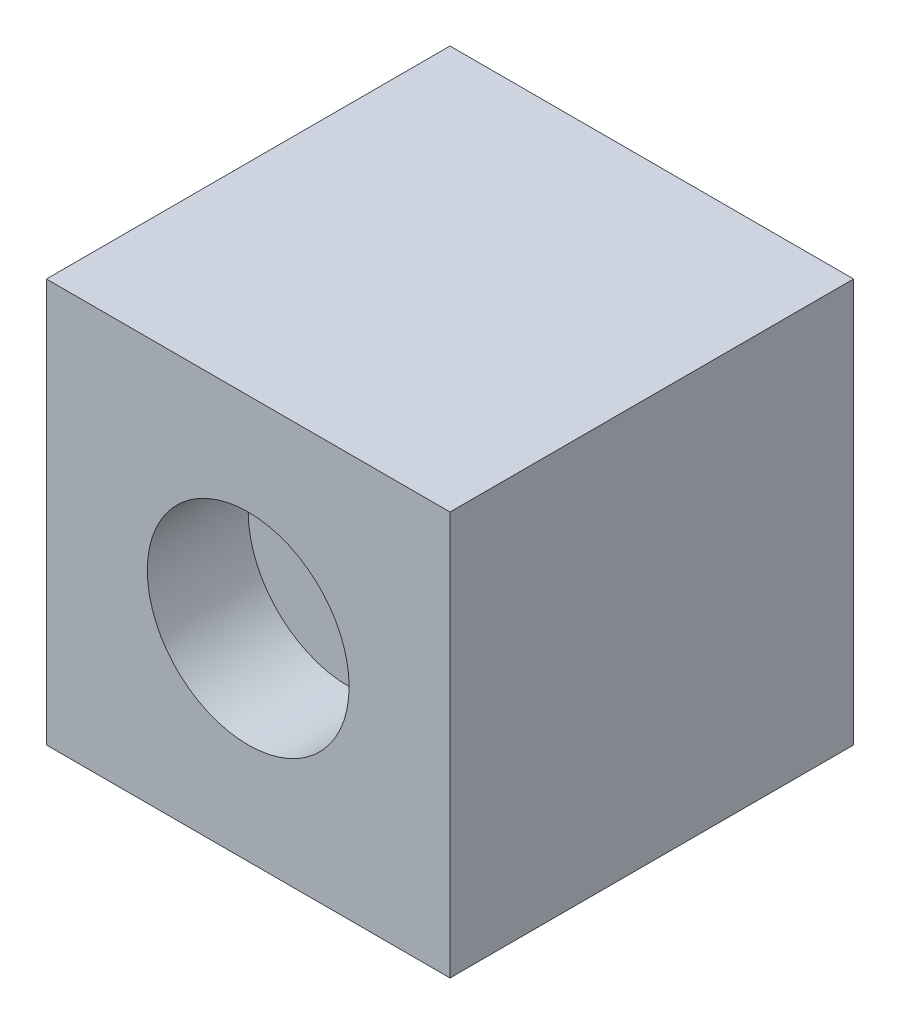
ISO-10303-21;
HEADER;
FILE_DESCRIPTION(('STEP AP214'),'2;1');
FILE_NAME('part.step','',(''),(''),'','','');
FILE_SCHEMA(('AUTOMOTIVE_DESIGN { 1 0 10303 214 1 1 1 1 }'));
ENDSEC;
DATA;
#1=APPLICATION_CONTEXT('core data for automotive mechanical design processes');
#2=APPLICATION_PROTOCOL_DEFINITION('international standard','automotive_design',2000,#1);
#3=PRODUCT_CONTEXT('',#1,'mechanical');
#4=PRODUCT('Part','Part','',(#3));
#5=PRODUCT_RELATED_PRODUCT_CATEGORY('part','',(#4));
#6=PRODUCT_DEFINITION_FORMATION('','',#4);
#7=PRODUCT_DEFINITION_CONTEXT('part definition',#1,'design');
#8=PRODUCT_DEFINITION('design','',#6,#7);
#9=PRODUCT_DEFINITION_SHAPE('','',#8);
#10=(LENGTH_UNIT() NAMED_UNIT(*) SI_UNIT(.MILLI.,.METRE.));
#11=(NAMED_UNIT(*) PLANE_ANGLE_UNIT() SI_UNIT($,.RADIAN.));
#12=(NAMED_UNIT(*) SI_UNIT($,.STERADIAN.) SOLID_ANGLE_UNIT());
#13=UNCERTAINTY_MEASURE_WITH_UNIT(LENGTH_MEASURE(1.E-05),#10,'distance_accuracy_value','');
#14=(GEOMETRIC_REPRESENTATION_CONTEXT(3) GLOBAL_UNCERTAINTY_ASSIGNED_CONTEXT((#13)) GLOBAL_UNIT_ASSIGNED_CONTEXT((#10,
#11,#12)) REPRESENTATION_CONTEXT('',''));
#15=CARTESIAN_POINT('',(0.,0.,0.));
#16=DIRECTION('',(0.,0.,1.));
#17=DIRECTION('',(1.,0.,0.));
#18=AXIS2_PLACEMENT_3D('',#15,#16,#17);
#19=CARTESIAN_POINT('',(-25.4,25.4,50.8));
#20=DIRECTION('',(1.,0.,0.));
#21=DIRECTION('',(0.,1.,0.));
#22=AXIS2_PLACEMENT_3D('',#19,#20,#21);
#23=PLANE('',#22);
#24=DIRECTION('',(0.,-1.,0.));
#25=VECTOR('',#24,1.);
#26=CARTESIAN_POINT('',(-25.4,25.4,0.));
#27=LINE('',#26,#25);
#28=CARTESIAN_POINT('',(-25.4,25.4,0.));
#29=VERTEX_POINT('',#28);
#30=CARTESIAN_POINT('',(-25.4,-25.4,0.));
#31=VERTEX_POINT('',#30);
#32=EDGE_CURVE('E96',#29,#31,#27,.T.);
#33=ORIENTED_EDGE('',*,*,#32,.T.);
#34=DIRECTION('',(0.,0.,-1.));
#35=VECTOR('',#34,1.);
#36=CARTESIAN_POINT('',(-25.4,-25.4,50.8));
#37=LINE('',#36,#35);
#38=CARTESIAN_POINT('',(-25.4,-25.4,50.8));
#39=VERTEX_POINT('',#38);
#40=EDGE_CURVE('E11',#39,#31,#37,.T.);
#41=ORIENTED_EDGE('',*,*,#40,.F.);
#42=DIRECTION('',(0.,-1.,0.));
#43=VECTOR('',#42,1.);
#44=CARTESIAN_POINT('',(-25.4,25.4,50.8));
#45=LINE('',#44,#43);
#46=CARTESIAN_POINT('',(-25.4,25.4,50.8));
#47=VERTEX_POINT('',#46);
#48=EDGE_CURVE('E84',#47,#39,#45,.T.);
#49=ORIENTED_EDGE('',*,*,#48,.F.);
#50=DIRECTION('',(0.,0.,-1.));
#51=VECTOR('',#50,1.);
#52=CARTESIAN_POINT('',(-25.4,25.4,50.8));
#53=LINE('',#52,#51);
#54=EDGE_CURVE('E92',#47,#29,#53,.T.);
#55=ORIENTED_EDGE('',*,*,#54,.T.);
#56=EDGE_LOOP('',(#33,#41,#49,#55));
#57=FACE_BOUND('',#56,.T.);
#58=ADVANCED_FACE('F33',(#57),#23,.F.);
#59=CARTESIAN_POINT('',(-25.4,-25.4,50.8));
#60=DIRECTION('',(0.,1.,0.));
#61=DIRECTION('',(0.,0.,1.));
#62=AXIS2_PLACEMENT_3D('',#59,#60,#61);
#63=PLANE('',#62);
#64=DIRECTION('',(1.,0.,0.));
#65=VECTOR('',#64,1.);
#66=CARTESIAN_POINT('',(-25.4,-25.4,0.));
#67=LINE('',#66,#65);
#68=CARTESIAN_POINT('',(25.4,-25.4,0.));
#69=VERTEX_POINT('',#68);
#70=EDGE_CURVE('E88',#31,#69,#67,.T.);
#71=ORIENTED_EDGE('',*,*,#70,.T.);
#72=DIRECTION('',(0.,0.,-1.));
#73=VECTOR('',#72,1.);
#74=CARTESIAN_POINT('',(25.4,-25.4,50.8));
#75=LINE('',#74,#73);
#76=CARTESIAN_POINT('',(25.4,-25.4,50.8));
#77=VERTEX_POINT('',#76);
#78=EDGE_CURVE('E41',#77,#69,#75,.T.);
#79=ORIENTED_EDGE('',*,*,#78,.F.);
#80=DIRECTION('',(1.,0.,0.));
#81=VECTOR('',#80,1.);
#82=CARTESIAN_POINT('',(-25.4,-25.4,50.8));
#83=LINE('',#82,#81);
#84=EDGE_CURVE('E79',#39,#77,#83,.T.);
#85=ORIENTED_EDGE('',*,*,#84,.F.);
#86=ORIENTED_EDGE('',*,*,#40,.T.);
#87=EDGE_LOOP('',(#71,#79,#85,#86));
#88=FACE_BOUND('',#87,.T.);
#89=ADVANCED_FACE('F87',(#88),#63,.F.);
#90=CARTESIAN_POINT('',(25.4,25.4,50.8));
#91=DIRECTION('',(-1.,0.,0.));
#92=DIRECTION('',(0.,-1.,0.));
#93=AXIS2_PLACEMENT_3D('',#90,#91,#92);
#94=PLANE('',#93);
#95=DIRECTION('',(0.,1.,0.));
#96=VECTOR('',#95,1.);
#97=CARTESIAN_POINT('',(25.4,25.4,0.));
#98=LINE('',#97,#96);
#99=CARTESIAN_POINT('',(25.4,25.4,0.));
#100=VERTEX_POINT('',#99);
#101=EDGE_CURVE('E66',#69,#100,#98,.T.);
#102=ORIENTED_EDGE('',*,*,#101,.T.);
#103=DIRECTION('',(0.,0.,-1.));
#104=VECTOR('',#103,1.);
#105=CARTESIAN_POINT('',(25.4,25.4,50.8));
#106=LINE('',#105,#104);
#107=CARTESIAN_POINT('',(25.4,25.4,50.8));
#108=VERTEX_POINT('',#107);
#109=EDGE_CURVE('E89',#108,#100,#106,.T.);
#110=ORIENTED_EDGE('',*,*,#109,.F.);
#111=DIRECTION('',(0.,1.,0.));
#112=VECTOR('',#111,1.);
#113=CARTESIAN_POINT('',(25.4,25.4,50.8));
#114=LINE('',#113,#112);
#115=EDGE_CURVE('E82',#77,#108,#114,.T.);
#116=ORIENTED_EDGE('',*,*,#115,.F.);
#117=ORIENTED_EDGE('',*,*,#78,.T.);
#118=EDGE_LOOP('',(#102,#110,#116,#117));
#119=FACE_BOUND('',#118,.T.);
#120=ADVANCED_FACE('F90',(#119),#94,.F.);
#121=CARTESIAN_POINT('',(-25.4,25.4,50.8));
#122=DIRECTION('',(0.,-1.,0.));
#123=DIRECTION('',(0.,0.,-1.));
#124=AXIS2_PLACEMENT_3D('',#121,#122,#123);
#125=PLANE('',#124);
#126=DIRECTION('',(-1.,0.,0.));
#127=VECTOR('',#126,1.);
#128=CARTESIAN_POINT('',(-25.4,25.4,0.));
#129=LINE('',#128,#127);
#130=EDGE_CURVE('E72',#100,#29,#129,.T.);
#131=ORIENTED_EDGE('',*,*,#130,.T.);
#132=ORIENTED_EDGE('',*,*,#54,.F.);
#133=DIRECTION('',(-1.,0.,0.));
#134=VECTOR('',#133,1.);
#135=CARTESIAN_POINT('',(-25.4,25.4,50.8));
#136=LINE('',#135,#134);
#137=EDGE_CURVE('E49',#108,#47,#136,.T.);
#138=ORIENTED_EDGE('',*,*,#137,.F.);
#139=ORIENTED_EDGE('',*,*,#109,.T.);
#140=EDGE_LOOP('',(#131,#132,#138,#139));
#141=FACE_BOUND('',#140,.T.);
#142=ADVANCED_FACE('F104',(#141),#125,.F.);
#143=CARTESIAN_POINT('',(0.,0.,50.8));
#144=DIRECTION('',(0.,0.,1.));
#145=DIRECTION('',(1.,0.,0.));
#146=AXIS2_PLACEMENT_3D('',#143,#144,#145);
#147=PLANE('',#146);
#148=CARTESIAN_POINT('',(0.,0.,50.8));
#149=DIRECTION('',(0.,0.,1.));
#150=DIRECTION('',(1.,0.,0.));
#151=AXIS2_PLACEMENT_3D('',#148,#149,#150);
#152=CIRCLE('',#151,12.7);
#153=CARTESIAN_POINT('',(12.7,0.,50.8));
#154=VERTEX_POINT('',#153);
#155=EDGE_CURVE('E110',#154,#154,#152,.T.);
#156=ORIENTED_EDGE('',*,*,#155,.F.);
#157=EDGE_LOOP('',(#156));
#158=FACE_BOUND('',#157,.T.);
#159=ORIENTED_EDGE('',*,*,#48,.T.);
#160=ORIENTED_EDGE('',*,*,#84,.T.);
#161=ORIENTED_EDGE('',*,*,#115,.T.);
#162=ORIENTED_EDGE('',*,*,#137,.T.);
#163=EDGE_LOOP('',(#159,#160,#161,#162));
#164=FACE_BOUND('',#163,.T.);
#165=ADVANCED_FACE('F80',(#158,#164),#147,.T.);
#166=CARTESIAN_POINT('',(0.,0.,0.));
#167=DIRECTION('',(0.,0.,1.));
#168=DIRECTION('',(1.,0.,0.));
#169=AXIS2_PLACEMENT_3D('',#166,#167,#168);
#170=PLANE('',#169);
#171=ORIENTED_EDGE('',*,*,#32,.F.);
#172=ORIENTED_EDGE('',*,*,#130,.F.);
#173=ORIENTED_EDGE('',*,*,#101,.F.);
#174=ORIENTED_EDGE('',*,*,#70,.F.);
#175=EDGE_LOOP('',(#171,#172,#173,#174));
#176=FACE_BOUND('',#175,.T.);
#177=ADVANCED_FACE('F107',(#176),#170,.F.);
#178=CARTESIAN_POINT('',(0.,0.,38.1));
#179=DIRECTION('',(0.,0.,1.));
#180=DIRECTION('',(1.,0.,0.));
#181=AXIS2_PLACEMENT_3D('',#178,#179,#180);
#182=CYLINDRICAL_SURFACE('',#181,12.7);
#183=CARTESIAN_POINT('',(0.,0.,38.1));
#184=DIRECTION('',(0.,0.,1.));
#185=DIRECTION('',(1.,0.,0.));
#186=AXIS2_PLACEMENT_3D('',#183,#184,#185);
#187=CIRCLE('',#186,12.7);
#188=CARTESIAN_POINT('',(12.7,0.,38.1));
#189=VERTEX_POINT('',#188);
#190=EDGE_CURVE('E99',#189,#189,#187,.T.);
#191=ORIENTED_EDGE('',*,*,#190,.F.);
#192=EDGE_LOOP('',(#191));
#193=FACE_BOUND('',#192,.T.);
#194=ORIENTED_EDGE('',*,*,#155,.T.);
#195=EDGE_LOOP('',(#194));
#196=FACE_BOUND('',#195,.T.);
#197=ADVANCED_FACE('F118',(#193,#196),#182,.F.);
#198=CARTESIAN_POINT('',(0.,0.,38.1));
#199=DIRECTION('',(0.,0.,1.));
#200=DIRECTION('',(1.,0.,0.));
#201=AXIS2_PLACEMENT_3D('',#198,#199,#200);
#202=PLANE('',#201);
#203=ORIENTED_EDGE('',*,*,#190,.T.);
#204=EDGE_LOOP('',(#203));
#205=FACE_BOUND('',#204,.T.);
#206=ADVANCED_FACE('F116',(#205),#202,.T.);
#207=CLOSED_SHELL('',(#58,#89,#120,#142,#165,#177,#197,#206));
#208=MANIFOLD_SOLID_BREP('B2',#207);
#209=ADVANCED_BREP_SHAPE_REPRESENTATION('',(#18,#208),#14);
#210=SHAPE_DEFINITION_REPRESENTATION(#9,#209);
ENDSEC;
END-ISO-10303-21;
